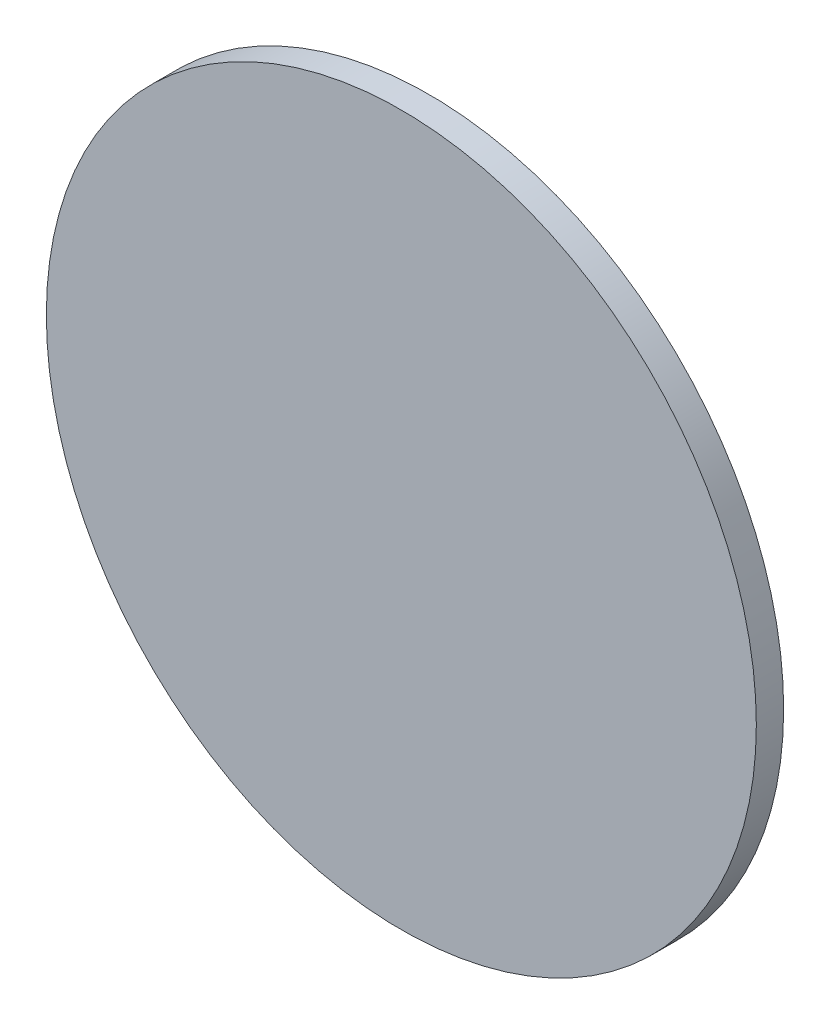
ISO-10303-21;
HEADER;
FILE_DESCRIPTION(('STEP AP214'),'2;1');
FILE_NAME('part.step','',(''),(''),'','','');
FILE_SCHEMA(('AUTOMOTIVE_DESIGN { 1 0 10303 214 1 1 1 1 }'));
ENDSEC;
DATA;
#1=APPLICATION_CONTEXT('core data for automotive mechanical design processes');
#2=APPLICATION_PROTOCOL_DEFINITION('international standard','automotive_design',2000,#1);
#3=PRODUCT_CONTEXT('',#1,'mechanical');
#4=PRODUCT('Part','Part','',(#3));
#5=PRODUCT_RELATED_PRODUCT_CATEGORY('part','',(#4));
#6=PRODUCT_DEFINITION_FORMATION('','',#4);
#7=PRODUCT_DEFINITION_CONTEXT('part definition',#1,'design');
#8=PRODUCT_DEFINITION('design','',#6,#7);
#9=PRODUCT_DEFINITION_SHAPE('','',#8);
#10=(LENGTH_UNIT() NAMED_UNIT(*) SI_UNIT(.MILLI.,.METRE.));
#11=(NAMED_UNIT(*) PLANE_ANGLE_UNIT() SI_UNIT($,.RADIAN.));
#12=(NAMED_UNIT(*) SI_UNIT($,.STERADIAN.) SOLID_ANGLE_UNIT());
#13=UNCERTAINTY_MEASURE_WITH_UNIT(LENGTH_MEASURE(1.E-05),#10,'distance_accuracy_value','');
#14=(GEOMETRIC_REPRESENTATION_CONTEXT(3) GLOBAL_UNCERTAINTY_ASSIGNED_CONTEXT((#13)) GLOBAL_UNIT_ASSIGNED_CONTEXT((#10,
#11,#12)) REPRESENTATION_CONTEXT('',''));
#15=CARTESIAN_POINT('',(0.,0.,0.));
#16=DIRECTION('',(0.,0.,1.));
#17=DIRECTION('',(1.,0.,0.));
#18=AXIS2_PLACEMENT_3D('',#15,#16,#17);
#19=CARTESIAN_POINT('',(-31.5326870594106,19.9144592798461,12.7));
#20=DIRECTION('',(0.,0.,-1.));
#21=DIRECTION('',(-1.,0.,0.));
#22=AXIS2_PLACEMENT_3D('',#19,#20,#21);
#23=CYLINDRICAL_SURFACE('',#22,165.062282848658);
#24=CARTESIAN_POINT('',(-31.5326870594106,19.9144592798461,12.7));
#25=DIRECTION('',(0.,0.,1.));
#26=DIRECTION('',(1.,0.,0.));
#27=AXIS2_PLACEMENT_3D('',#24,#25,#26);
#28=CIRCLE('',#27,165.062282848658);
#29=CARTESIAN_POINT('',(133.529595789248,19.9144592798461,12.7));
#30=VERTEX_POINT('',#29);
#31=EDGE_CURVE('E10',#30,#30,#28,.T.);
#32=ORIENTED_EDGE('',*,*,#31,.F.);
#33=EDGE_LOOP('',(#32));
#34=FACE_BOUND('',#33,.T.);
#35=CARTESIAN_POINT('',(-31.5326870594106,19.9144592798461,0.));
#36=DIRECTION('',(0.,0.,1.));
#37=DIRECTION('',(1.,0.,0.));
#38=AXIS2_PLACEMENT_3D('',#35,#36,#37);
#39=CIRCLE('',#38,165.062282848658);
#40=CARTESIAN_POINT('',(133.529595789248,19.9144592798461,0.));
#41=VERTEX_POINT('',#40);
#42=EDGE_CURVE('E36',#41,#41,#39,.T.);
#43=ORIENTED_EDGE('',*,*,#42,.T.);
#44=EDGE_LOOP('',(#43));
#45=FACE_BOUND('',#44,.T.);
#46=ADVANCED_FACE('F33',(#34,#45),#23,.T.);
#47=CARTESIAN_POINT('',(-31.5326870594106,19.9144592798461,12.7));
#48=DIRECTION('',(0.,0.,1.));
#49=DIRECTION('',(1.,0.,0.));
#50=AXIS2_PLACEMENT_3D('',#47,#48,#49);
#51=PLANE('',#50);
#52=ORIENTED_EDGE('',*,*,#31,.T.);
#53=EDGE_LOOP('',(#52));
#54=FACE_BOUND('',#53,.T.);
#55=ADVANCED_FACE('F48',(#54),#51,.T.);
#56=CARTESIAN_POINT('',(-31.5326870594106,19.9144592798461,0.));
#57=DIRECTION('',(0.,0.,1.));
#58=DIRECTION('',(1.,0.,0.));
#59=AXIS2_PLACEMENT_3D('',#56,#57,#58);
#60=PLANE('',#59);
#61=ORIENTED_EDGE('',*,*,#42,.F.);
#62=EDGE_LOOP('',(#61));
#63=FACE_BOUND('',#62,.T.);
#64=ADVANCED_FACE('F46',(#63),#60,.F.);
#65=CLOSED_SHELL('',(#46,#55,#64));
#66=MANIFOLD_SOLID_BREP('B2',#65);
#67=ADVANCED_BREP_SHAPE_REPRESENTATION('',(#18,#66),#14);
#68=SHAPE_DEFINITION_REPRESENTATION(#9,#67);
ENDSEC;
END-ISO-10303-21;
